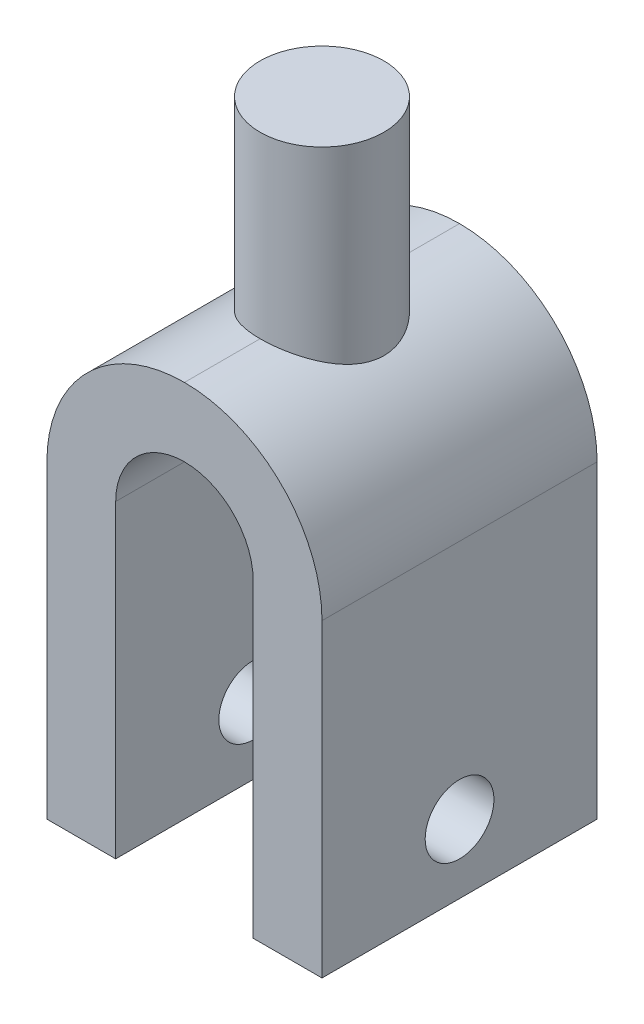
ISO-10303-21;
HEADER;
FILE_DESCRIPTION(('STEP AP214'),'2;1');
FILE_NAME('part.step','',(''),(''),'','','');
FILE_SCHEMA(('AUTOMOTIVE_DESIGN { 1 0 10303 214 1 1 1 1 }'));
ENDSEC;
DATA;
#1=APPLICATION_CONTEXT('core data for automotive mechanical design processes');
#2=APPLICATION_PROTOCOL_DEFINITION('international standard','automotive_design',2000,#1);
#3=PRODUCT_CONTEXT('',#1,'mechanical');
#4=PRODUCT('Part','Part','',(#3));
#5=PRODUCT_RELATED_PRODUCT_CATEGORY('part','',(#4));
#6=PRODUCT_DEFINITION_FORMATION('','',#4);
#7=PRODUCT_DEFINITION_CONTEXT('part definition',#1,'design');
#8=PRODUCT_DEFINITION('design','',#6,#7);
#9=PRODUCT_DEFINITION_SHAPE('','',#8);
#10=(LENGTH_UNIT() NAMED_UNIT(*) SI_UNIT(.MILLI.,.METRE.));
#11=(NAMED_UNIT(*) PLANE_ANGLE_UNIT() SI_UNIT($,.RADIAN.));
#12=(NAMED_UNIT(*) SI_UNIT($,.STERADIAN.) SOLID_ANGLE_UNIT());
#13=UNCERTAINTY_MEASURE_WITH_UNIT(LENGTH_MEASURE(1.E-05),#10,'distance_accuracy_value','');
#14=(GEOMETRIC_REPRESENTATION_CONTEXT(3) GLOBAL_UNCERTAINTY_ASSIGNED_CONTEXT((#13)) GLOBAL_UNIT_ASSIGNED_CONTEXT((#10,
#11,#12)) REPRESENTATION_CONTEXT('',''));
#15=CARTESIAN_POINT('',(0.,0.,0.));
#16=DIRECTION('',(0.,0.,1.));
#17=DIRECTION('',(1.,0.,0.));
#18=AXIS2_PLACEMENT_3D('',#15,#16,#17);
#19=CARTESIAN_POINT('',(0.,-13.,0.));
#20=DIRECTION('',(0.,1.,0.));
#21=DIRECTION('',(-1.,0.,0.));
#22=AXIS2_PLACEMENT_3D('',#19,#20,#21);
#23=CYLINDRICAL_SURFACE('',#22,4.5);
#24=CARTESIAN_POINT('',(0.,-13.,-4.5));
#25=CARTESIAN_POINT('',(-0.120178151652791,-12.9999796580155,-4.50001917389403));
#26=CARTESIAN_POINT('',(-0.240346836842313,-13.0021656662358,-4.49518660422828));
#27=CARTESIAN_POINT('',(-0.47972214591831,-13.0108010186802,-4.47596163300541));
#28=CARTESIAN_POINT('',(-0.59892909053476,-13.0172488766409,-4.46157256414149));
#29=CARTESIAN_POINT('',(-0.835052461657781,-13.0342249399961,-4.42345399919402));
#30=CARTESIAN_POINT('',(-0.95197611092277,-13.0447368195346,-4.39976186917934));
#31=CARTESIAN_POINT('',(-1.18319642373561,-13.069563840303,-4.34329470431343));
#32=CARTESIAN_POINT('',(-1.29749295301557,-13.0838791754538,-4.31051920633869));
#33=CARTESIAN_POINT('',(-1.52256972965127,-13.1159378331901,-4.23624898364253));
#34=CARTESIAN_POINT('',(-1.63335400755732,-13.1336770476286,-4.19476470299124));
#35=CARTESIAN_POINT('',(-1.85089340943453,-13.1721608743311,-4.10342907339228));
#36=CARTESIAN_POINT('',(-1.95764700290549,-13.1929066140268,-4.053574584543));
#37=CARTESIAN_POINT('',(-2.27102094071684,-13.2589571281215,-3.89199694279532));
#38=CARTESIAN_POINT('',(-2.47078895139681,-13.3080803389199,-3.7682481251324));
#39=CARTESIAN_POINT('',(-2.85733198501434,-13.4146989413133,-3.48511508511232));
#40=CARTESIAN_POINT('',(-3.04291597172282,-13.4724944260924,-3.32422927891433));
#41=CARTESIAN_POINT('',(-3.38552575205056,-13.5887849987989,-2.97459101208405));
#42=CARTESIAN_POINT('',(-3.5425372086695,-13.6472804223361,-2.78582464725385));
#43=CARTESIAN_POINT('',(-3.83290511249483,-13.7623204503021,-2.37198960822757));
#44=CARTESIAN_POINT('',(-3.96429305261986,-13.8185408031006,-2.14542753907891));
#45=CARTESIAN_POINT('',(-4.13093668311398,-13.892911754813,-1.78957792461262));
#46=CARTESIAN_POINT('',(-4.18142405814915,-13.9160486023375,-1.66824759865613));
#47=CARTESIAN_POINT('',(-4.27176661677812,-13.958180588836,-1.42101889157476));
#48=CARTESIAN_POINT('',(-4.31162755738027,-13.9771779693967,-1.29512302606237));
#49=CARTESIAN_POINT('',(-4.37841963354644,-14.0094080354816,-1.04648496232591));
#50=CARTESIAN_POINT('',(-4.4059237972701,-14.0228927646251,-0.923928931090382));
#51=CARTESIAN_POINT('',(-4.45062239398908,-14.0449687804154,-0.676567732713107));
#52=CARTESIAN_POINT('',(-4.46782183646064,-14.0535624446738,-0.55176368885237));
#53=CARTESIAN_POINT('',(-4.49169191630349,-14.0655227769069,-0.300945708173625));
#54=CARTESIAN_POINT('',(-4.49836621736068,-14.0688912637019,-0.174932207727762));
#55=CARTESIAN_POINT('',(-4.50110348711771,-14.0702704288533,0.0772334960799677));
#56=CARTESIAN_POINT('',(-4.49716716504251,-14.0682814653072,0.203385689608052));
#57=CARTESIAN_POINT('',(-4.47959275843586,-14.0594555947932,0.443079858232079));
#58=CARTESIAN_POINT('',(-4.4668864266058,-14.053084470478,0.556708209979897));
#59=CARTESIAN_POINT('',(-4.4329358291197,-14.0362158275964,0.782382462581468));
#60=CARTESIAN_POINT('',(-4.41168881196357,-14.0257169792504,0.894427841405261));
#61=CARTESIAN_POINT('',(-4.33544465449631,-13.9884956407401,1.22700182834881));
#62=CARTESIAN_POINT('',(-4.26792995048192,-13.9560404603598,1.44415990475641));
#63=CARTESIAN_POINT('',(-4.10015973351193,-13.8787434590063,1.8687098930679));
#64=CARTESIAN_POINT('',(-3.99919788379175,-13.8336379537341,2.07576959448095));
#65=CARTESIAN_POINT('',(-3.76787788282298,-13.7361549390986,2.47093625011075));
#66=CARTESIAN_POINT('',(-3.63750664038478,-13.6837741952648,2.65903470987385));
#67=CARTESIAN_POINT('',(-3.33583882999429,-13.5712882104201,3.03069111586636));
#68=CARTESIAN_POINT('',(-3.16175229578375,-13.5109345399448,3.21191076910353));
#69=CARTESIAN_POINT('',(-2.78502111429768,-13.3936239645608,3.54352303924676));
#70=CARTESIAN_POINT('',(-2.58236507248389,-13.3366684279114,3.69390329727291));
#71=CARTESIAN_POINT('',(-2.25715889145779,-13.257397721077,3.895155288357));
#72=CARTESIAN_POINT('',(-2.14327023309438,-13.2316516140445,3.95897779521262));
#73=CARTESIAN_POINT('',(-1.90985160011112,-13.1833489365827,4.07670533847978));
#74=CARTESIAN_POINT('',(-1.7903241115997,-13.1607909777368,4.13061469509867));
#75=CARTESIAN_POINT('',(-1.54657596766782,-13.1195463000535,4.22791973859671));
#76=CARTESIAN_POINT('',(-1.42236076837655,-13.1008552353452,4.27132723755885));
#77=CARTESIAN_POINT('',(-1.17012398192434,-13.0678809920973,4.3472006424134));
#78=CARTESIAN_POINT('',(-1.04210395426167,-13.0535960341991,4.3796709656548));
#79=CARTESIAN_POINT('',(-0.763049443416737,-13.0280250136243,4.4374622337394));
#80=CARTESIAN_POINT('',(-0.61153587094907,-13.0175525076043,4.46088210394797));
#81=CARTESIAN_POINT('',(-0.382920521920435,-13.0070418124399,4.48433431388868));
#82=CARTESIAN_POINT('',(-0.306485328663385,-13.0044045884957,4.49020545364922));
#83=CARTESIAN_POINT('',(-0.153372736859748,-13.0008828464352,4.49803856615036));
#84=CARTESIAN_POINT('',(-0.0766953320658565,-12.9999983739031,4.50000043722177));
#85=CARTESIAN_POINT('',(0.,-13.,4.5));
#86=B_SPLINE_CURVE_WITH_KNOTS('',3,(#24,#25,#26,#27,#28,#29,#30,#31,#32,#33,#34,#35,#36,#37,#38,
#39,#40,#41,#42,#43,#44,#45,#46,#47,#48,#49,#50,#51,#52,#53,#54,#55,#56,#57,#58,#59,#60,#61,#62,
#63,#64,#65,#66,#67,#68,#69,#70,#71,#72,#73,#74,#75,#76,#77,#78,#79,#80,#81,#82,#83,#84,#85),
.UNSPECIFIED.,.F.,.F.,(4,2,2,2,2,2,2,2,2,2,2,2,2,2,2,2,2,2,2,2,2,2,2,2,2,2,2,2,2,2,4),(0.,
0.360402629916075,0.720679640489278,1.07952414929391,1.43838695746854,1.79682183057066,
2.15539146438408,2.8724218148803,3.62620944877876,4.38037427827777,5.17950403841125,
5.57935364606037,5.97898618774588,6.35745115539153,6.73573198871505,7.11388111755436,
7.49200497114335,7.83512845896268,8.17836257747507,8.86426099203829,9.56568100304049,
10.2674138598626,11.0393741953104,11.8116432917185,12.2104048263552,12.6089921644363,
13.0071290806821,13.4051050024936,13.8650631802428,14.0950775422091,14.3250978861301),.UNSPECIFIED.);
#87=CARTESIAN_POINT('',(0.,-13.,-4.5));
#88=VERTEX_POINT('',#87);
#89=CARTESIAN_POINT('',(0.,-13.,4.5));
#90=VERTEX_POINT('',#89);
#91=EDGE_CURVE('E11',#88,#90,#86,.T.);
#92=ORIENTED_EDGE('',*,*,#91,.T.);
#93=CARTESIAN_POINT('',(0.,-13.,4.5));
#94=CARTESIAN_POINT('',(0.120178151652796,-12.9999796580155,4.50001917389403));
#95=CARTESIAN_POINT('',(0.240346836842318,-13.0021656662358,4.49518660422828));
#96=CARTESIAN_POINT('',(0.479722145918315,-13.0108010186802,4.47596163300541));
#97=CARTESIAN_POINT('',(0.598929090534764,-13.0172488766409,4.46157256414149));
#98=CARTESIAN_POINT('',(0.835052461657785,-13.0342249399961,4.42345399919402));
#99=CARTESIAN_POINT('',(0.951976110922774,-13.0447368195346,4.39976186917934));
#100=CARTESIAN_POINT('',(1.18319642373561,-13.069563840303,4.34329470431343));
#101=CARTESIAN_POINT('',(1.29749295301557,-13.0838791754538,4.31051920633869));
#102=CARTESIAN_POINT('',(1.52256972965127,-13.1159378331901,4.23624898364253));
#103=CARTESIAN_POINT('',(1.63335400755732,-13.1336770476286,4.19476470299124));
#104=CARTESIAN_POINT('',(1.85089340943453,-13.1721608743311,4.10342907339228));
#105=CARTESIAN_POINT('',(1.95764700290549,-13.1929066140268,4.053574584543));
#106=CARTESIAN_POINT('',(2.27102094071685,-13.2589571281215,3.89199694279531));
#107=CARTESIAN_POINT('',(2.47078895139682,-13.3080803389199,3.7682481251324));
#108=CARTESIAN_POINT('',(2.85733198501435,-13.4146989413133,3.48511508511231));
#109=CARTESIAN_POINT('',(3.04291597172283,-13.4724944260924,3.32422927891432));
#110=CARTESIAN_POINT('',(3.38552575205057,-13.5887849987989,2.97459101208405));
#111=CARTESIAN_POINT('',(3.54253720866951,-13.6472804223361,2.78582464725384));
#112=CARTESIAN_POINT('',(3.83290511249484,-13.7623204503021,2.37198960822757));
#113=CARTESIAN_POINT('',(3.96429305261986,-13.8185408031006,2.1454275390789));
#114=CARTESIAN_POINT('',(4.13093668311398,-13.892911754813,1.78957792461261));
#115=CARTESIAN_POINT('',(4.18142405814915,-13.9160486023375,1.66824759865612));
#116=CARTESIAN_POINT('',(4.27176661677812,-13.958180588836,1.42101889157475));
#117=CARTESIAN_POINT('',(4.31162755738027,-13.9771779693967,1.29512302606236));
#118=CARTESIAN_POINT('',(4.37841963354644,-14.0094080354816,1.0464849623259));
#119=CARTESIAN_POINT('',(4.4059237972701,-14.0228927646251,0.923928931090373));
#120=CARTESIAN_POINT('',(4.45062239398908,-14.0449687804154,0.676567732713099));
#121=CARTESIAN_POINT('',(4.46782183646065,-14.0535624446738,0.551763688852362));
#122=CARTESIAN_POINT('',(4.49169191630349,-14.0655227769069,0.300945708173618));
#123=CARTESIAN_POINT('',(4.49836621736068,-14.0688912637019,0.174932207727755));
#124=CARTESIAN_POINT('',(4.50110348711771,-14.0702704288533,-0.077233496079973));
#125=CARTESIAN_POINT('',(4.49716716504251,-14.0682814653072,-0.203385689608057));
#126=CARTESIAN_POINT('',(4.47959275843586,-14.0594555947932,-0.443079858232084));
#127=CARTESIAN_POINT('',(4.4668864266058,-14.053084470478,-0.556708209979902));
#128=CARTESIAN_POINT('',(4.4329358291197,-14.0362158275964,-0.782382462581474));
#129=CARTESIAN_POINT('',(4.41168881196357,-14.0257169792504,-0.894427841405267));
#130=CARTESIAN_POINT('',(4.33544465449631,-13.9884956407401,-1.22700182834882));
#131=CARTESIAN_POINT('',(4.26792995048192,-13.9560404603598,-1.44415990475642));
#132=CARTESIAN_POINT('',(4.10015973351193,-13.8787434590063,-1.86870989306791));
#133=CARTESIAN_POINT('',(3.99919788379175,-13.8336379537341,-2.07576959448096));
#134=CARTESIAN_POINT('',(3.76787788282298,-13.7361549390986,-2.47093625011076));
#135=CARTESIAN_POINT('',(3.63750664038478,-13.6837741952648,-2.65903470987386));
#136=CARTESIAN_POINT('',(3.33583882999429,-13.5712882104201,-3.03069111586637));
#137=CARTESIAN_POINT('',(3.16175229578374,-13.5109345399447,-3.21191076910353));
#138=CARTESIAN_POINT('',(2.78502111429767,-13.3936239645607,-3.54352303924677));
#139=CARTESIAN_POINT('',(2.58236507248389,-13.3366684279114,-3.69390329727292));
#140=CARTESIAN_POINT('',(2.25715889145778,-13.257397721077,-3.89515528835701));
#141=CARTESIAN_POINT('',(2.14327023309437,-13.2316516140445,-3.95897779521263));
#142=CARTESIAN_POINT('',(1.90985160011111,-13.1833489365827,-4.07670533847979));
#143=CARTESIAN_POINT('',(1.79032411159969,-13.1607909777368,-4.13061469509867));
#144=CARTESIAN_POINT('',(1.54657596766782,-13.1195463000535,-4.22791973859672));
#145=CARTESIAN_POINT('',(1.42236076837654,-13.1008552353452,-4.27132723755885));
#146=CARTESIAN_POINT('',(1.17012398192434,-13.0678809920973,-4.3472006424134));
#147=CARTESIAN_POINT('',(1.04210395426166,-13.0535960341991,-4.3796709656548));
#148=CARTESIAN_POINT('',(0.763049443416733,-13.0280250136243,-4.4374622337394));
#149=CARTESIAN_POINT('',(0.611535870949068,-13.0175525076043,-4.46088210394797));
#150=CARTESIAN_POINT('',(0.382920521920436,-13.0070418124399,-4.48433431388868));
#151=CARTESIAN_POINT('',(0.306485328663387,-13.0044045884957,-4.49020545364922));
#152=CARTESIAN_POINT('',(0.153372736859752,-13.0008828464352,-4.49803856615036));
#153=CARTESIAN_POINT('',(0.0766953320658608,-12.9999983739031,-4.50000043722177));
#154=CARTESIAN_POINT('',(0.,-13.,-4.5));
#155=B_SPLINE_CURVE_WITH_KNOTS('',3,(#93,#94,#95,#96,#97,#98,#99,#100,#101,#102,#103,#104,#105,
#106,#107,#108,#109,#110,#111,#112,#113,#114,#115,#116,#117,#118,#119,#120,#121,#122,#123,#124,
#125,#126,#127,#128,#129,#130,#131,#132,#133,#134,#135,#136,#137,#138,#139,#140,#141,#142,#143,
#144,#145,#146,#147,#148,#149,#150,#151,#152,#153,#154),.UNSPECIFIED.,.F.,.F.,(4,2,2,2,2,2,2,2,
2,2,2,2,2,2,2,2,2,2,2,2,2,2,2,2,2,2,2,2,2,2,4),(0.,0.360402629916075,0.720679640489277,
1.07952414929391,1.43838695746853,1.79682183057065,2.15539146438408,2.87242181488031,
3.62620944877876,4.38037427827777,5.17950403841125,5.57935364606038,5.97898618774588,
6.35745115539153,6.73573198871505,7.11388111755436,7.49200497114335,7.83512845896269,
8.17836257747507,8.8642609920383,9.56568100304049,10.2674138598626,11.0393741953104,
11.8116432917185,12.2104048263552,12.6089921644363,13.0071290806821,13.4051050024936,
13.8650631802428,14.0950775422091,14.3250978861301),.UNSPECIFIED.);
#156=EDGE_CURVE('E30',#90,#88,#155,.T.);
#157=ORIENTED_EDGE('',*,*,#156,.T.);
#158=EDGE_LOOP('',(#92,#157));
#159=FACE_BOUND('',#158,.T.);
#160=CARTESIAN_POINT('',(0.,0.,0.));
#161=DIRECTION('',(0.,-1.,0.));
#162=DIRECTION('',(1.,0.,0.));
#163=AXIS2_PLACEMENT_3D('',#160,#161,#162);
#164=CIRCLE('',#163,4.5);
#165=CARTESIAN_POINT('',(4.5,0.,0.));
#166=VERTEX_POINT('',#165);
#167=EDGE_CURVE('E241',#166,#166,#164,.T.);
#168=ORIENTED_EDGE('',*,*,#167,.T.);
#169=EDGE_LOOP('',(#168));
#170=FACE_BOUND('',#169,.T.);
#171=ADVANCED_FACE('F17',(#159,#170),#23,.T.);
#172=CARTESIAN_POINT('',(0.,0.,0.));
#173=DIRECTION('',(0.,-1.,0.));
#174=DIRECTION('',(1.,0.,0.));
#175=AXIS2_PLACEMENT_3D('',#172,#173,#174);
#176=PLANE('',#175);
#177=ORIENTED_EDGE('',*,*,#167,.F.);
#178=EDGE_LOOP('',(#177));
#179=FACE_BOUND('',#178,.T.);
#180=ADVANCED_FACE('F252',(#179),#176,.F.);
#181=CARTESIAN_POINT('',(10.,-18.,10.));
#182=DIRECTION('',(-1.,0.,0.));
#183=DIRECTION('',(0.,0.,-1.));
#184=AXIS2_PLACEMENT_3D('',#181,#182,#183);
#185=PLANE('',#184);
#186=CARTESIAN_POINT('',(10.,-40.5,0.));
#187=DIRECTION('',(1.,0.,0.));
#188=DIRECTION('',(0.,0.,1.));
#189=AXIS2_PLACEMENT_3D('',#186,#187,#188);
#190=CIRCLE('',#189,2.5);
#191=CARTESIAN_POINT('',(10.,-40.5,2.5));
#192=VERTEX_POINT('',#191);
#193=EDGE_CURVE('E237',#192,#192,#190,.T.);
#194=ORIENTED_EDGE('',*,*,#193,.F.);
#195=EDGE_LOOP('',(#194));
#196=FACE_BOUND('',#195,.T.);
#197=DIRECTION('',(0.,1.,0.));
#198=VECTOR('',#197,1.);
#199=CARTESIAN_POINT('',(10.,-18.,-10.));
#200=LINE('',#199,#198);
#201=CARTESIAN_POINT('',(10.,-45.5,-10.));
#202=VERTEX_POINT('',#201);
#203=CARTESIAN_POINT('',(10.,-23.,-10.));
#204=VERTEX_POINT('',#203);
#205=EDGE_CURVE('E234',#202,#204,#200,.T.);
#206=ORIENTED_EDGE('',*,*,#205,.T.);
#207=DIRECTION('',(0.,0.,1.));
#208=VECTOR('',#207,1.);
#209=CARTESIAN_POINT('',(10.,-23.,10.));
#210=LINE('',#209,#208);
#211=CARTESIAN_POINT('',(10.,-23.,10.));
#212=VERTEX_POINT('',#211);
#213=EDGE_CURVE('E231',#204,#212,#210,.T.);
#214=ORIENTED_EDGE('',*,*,#213,.T.);
#215=DIRECTION('',(0.,1.,0.));
#216=VECTOR('',#215,1.);
#217=CARTESIAN_POINT('',(10.,-18.,10.));
#218=LINE('',#217,#216);
#219=CARTESIAN_POINT('',(10.,-45.5,10.));
#220=VERTEX_POINT('',#219);
#221=EDGE_CURVE('E227',#220,#212,#218,.T.);
#222=ORIENTED_EDGE('',*,*,#221,.F.);
#223=DIRECTION('',(0.,0.,1.));
#224=VECTOR('',#223,1.);
#225=CARTESIAN_POINT('',(10.,-45.5,10.));
#226=LINE('',#225,#224);
#227=EDGE_CURVE('E223',#202,#220,#226,.T.);
#228=ORIENTED_EDGE('',*,*,#227,.F.);
#229=EDGE_LOOP('',(#206,#214,#222,#228));
#230=FACE_BOUND('',#229,.T.);
#231=ADVANCED_FACE('F256',(#196,#230),#185,.F.);
#232=CARTESIAN_POINT('',(-10.,-18.,10.));
#233=DIRECTION('',(0.,0.,-1.));
#234=DIRECTION('',(0.,1.,0.));
#235=AXIS2_PLACEMENT_3D('',#232,#233,#234);
#236=PLANE('',#235);
#237=CARTESIAN_POINT('',(0.,-23.,10.));
#238=DIRECTION('',(0.,0.,-1.));
#239=DIRECTION('',(0.,1.,0.));
#240=AXIS2_PLACEMENT_3D('',#237,#238,#239);
#241=CIRCLE('',#240,10.);
#242=CARTESIAN_POINT('',(0.,-13.,10.));
#243=VERTEX_POINT('',#242);
#244=EDGE_CURVE('E220',#212,#243,#241,.F.);
#245=ORIENTED_EDGE('',*,*,#244,.T.);
#246=CARTESIAN_POINT('',(0.,-23.,10.));
#247=DIRECTION('',(0.,0.,-1.));
#248=DIRECTION('',(0.,1.,0.));
#249=AXIS2_PLACEMENT_3D('',#246,#247,#248);
#250=CIRCLE('',#249,10.);
#251=CARTESIAN_POINT('',(-10.,-23.,10.));
#252=VERTEX_POINT('',#251);
#253=EDGE_CURVE('E217',#243,#252,#250,.F.);
#254=ORIENTED_EDGE('',*,*,#253,.T.);
#255=DIRECTION('',(0.,1.,0.));
#256=VECTOR('',#255,1.);
#257=CARTESIAN_POINT('',(-10.,-18.,10.));
#258=LINE('',#257,#256);
#259=CARTESIAN_POINT('',(-10.,-45.5,10.));
#260=VERTEX_POINT('',#259);
#261=EDGE_CURVE('E213',#260,#252,#258,.T.);
#262=ORIENTED_EDGE('',*,*,#261,.F.);
#263=DIRECTION('',(-1.,0.,0.));
#264=VECTOR('',#263,1.);
#265=CARTESIAN_POINT('',(-10.,-45.5,10.));
#266=LINE('',#265,#264);
#267=CARTESIAN_POINT('',(-5.,-45.5,10.));
#268=VERTEX_POINT('',#267);
#269=EDGE_CURVE('E210',#268,#260,#266,.T.);
#270=ORIENTED_EDGE('',*,*,#269,.F.);
#271=DIRECTION('',(0.,1.,0.));
#272=VECTOR('',#271,1.);
#273=CARTESIAN_POINT('',(-5.,-45.5,10.));
#274=LINE('',#273,#272);
#275=CARTESIAN_POINT('',(-5.,-23.,10.));
#276=VERTEX_POINT('',#275);
#277=EDGE_CURVE('E144',#268,#276,#274,.T.);
#278=ORIENTED_EDGE('',*,*,#277,.T.);
#279=CARTESIAN_POINT('',(0.,-23.,10.));
#280=DIRECTION('',(0.,0.,-1.));
#281=DIRECTION('',(0.,1.,0.));
#282=AXIS2_PLACEMENT_3D('',#279,#280,#281);
#283=CIRCLE('',#282,5.);
#284=CARTESIAN_POINT('',(0.,-18.,10.));
#285=VERTEX_POINT('',#284);
#286=EDGE_CURVE('E205',#276,#285,#283,.T.);
#287=ORIENTED_EDGE('',*,*,#286,.T.);
#288=CARTESIAN_POINT('',(0.,-23.,10.));
#289=DIRECTION('',(0.,0.,-1.));
#290=DIRECTION('',(0.,1.,0.));
#291=AXIS2_PLACEMENT_3D('',#288,#289,#290);
#292=CIRCLE('',#291,5.);
#293=CARTESIAN_POINT('',(5.,-23.,10.));
#294=VERTEX_POINT('',#293);
#295=EDGE_CURVE('E202',#285,#294,#292,.T.);
#296=ORIENTED_EDGE('',*,*,#295,.T.);
#297=DIRECTION('',(0.,1.,0.));
#298=VECTOR('',#297,1.);
#299=CARTESIAN_POINT('',(5.,-45.5,10.));
#300=LINE('',#299,#298);
#301=CARTESIAN_POINT('',(5.,-45.5,10.));
#302=VERTEX_POINT('',#301);
#303=EDGE_CURVE('E198',#302,#294,#300,.T.);
#304=ORIENTED_EDGE('',*,*,#303,.F.);
#305=DIRECTION('',(-1.,0.,0.));
#306=VECTOR('',#305,1.);
#307=CARTESIAN_POINT('',(10.,-45.5,10.));
#308=LINE('',#307,#306);
#309=EDGE_CURVE('E194',#220,#302,#308,.T.);
#310=ORIENTED_EDGE('',*,*,#309,.F.);
#311=ORIENTED_EDGE('',*,*,#221,.T.);
#312=EDGE_LOOP('',(#245,#254,#262,#270,#278,#287,#296,#304,#310,#311));
#313=FACE_BOUND('',#312,.T.);
#314=ADVANCED_FACE('F260',(#313),#236,.F.);
#315=CARTESIAN_POINT('',(-10.,-18.,10.));
#316=DIRECTION('',(1.,0.,0.));
#317=DIRECTION('',(0.,0.,1.));
#318=AXIS2_PLACEMENT_3D('',#315,#316,#317);
#319=PLANE('',#318);
#320=CARTESIAN_POINT('',(-10.,-40.5,0.));
#321=DIRECTION('',(1.,0.,0.));
#322=DIRECTION('',(0.,0.,1.));
#323=AXIS2_PLACEMENT_3D('',#320,#321,#322);
#324=CIRCLE('',#323,2.5);
#325=CARTESIAN_POINT('',(-10.,-40.5,2.5));
#326=VERTEX_POINT('',#325);
#327=EDGE_CURVE('E190',#326,#326,#324,.T.);
#328=ORIENTED_EDGE('',*,*,#327,.T.);
#329=EDGE_LOOP('',(#328));
#330=FACE_BOUND('',#329,.T.);
#331=ORIENTED_EDGE('',*,*,#261,.T.);
#332=DIRECTION('',(0.,0.,-1.));
#333=VECTOR('',#332,1.);
#334=CARTESIAN_POINT('',(-10.,-23.,10.));
#335=LINE('',#334,#333);
#336=CARTESIAN_POINT('',(-10.,-23.,-10.));
#337=VERTEX_POINT('',#336);
#338=EDGE_CURVE('E187',#252,#337,#335,.T.);
#339=ORIENTED_EDGE('',*,*,#338,.T.);
#340=DIRECTION('',(0.,1.,0.));
#341=VECTOR('',#340,1.);
#342=CARTESIAN_POINT('',(-10.,-18.,-10.));
#343=LINE('',#342,#341);
#344=CARTESIAN_POINT('',(-10.,-45.5,-10.));
#345=VERTEX_POINT('',#344);
#346=EDGE_CURVE('E184',#345,#337,#343,.T.);
#347=ORIENTED_EDGE('',*,*,#346,.F.);
#348=DIRECTION('',(0.,0.,-1.));
#349=VECTOR('',#348,1.);
#350=CARTESIAN_POINT('',(-10.,-45.5,10.));
#351=LINE('',#350,#349);
#352=EDGE_CURVE('E153',#260,#345,#351,.T.);
#353=ORIENTED_EDGE('',*,*,#352,.F.);
#354=EDGE_LOOP('',(#331,#339,#347,#353));
#355=FACE_BOUND('',#354,.T.);
#356=ADVANCED_FACE('F264',(#330,#355),#319,.F.);
#357=CARTESIAN_POINT('',(-10.,-18.,-10.));
#358=DIRECTION('',(0.,0.,1.));
#359=DIRECTION('',(0.,-1.,0.));
#360=AXIS2_PLACEMENT_3D('',#357,#358,#359);
#361=PLANE('',#360);
#362=ORIENTED_EDGE('',*,*,#346,.T.);
#363=CARTESIAN_POINT('',(0.,-23.,-10.));
#364=DIRECTION('',(0.,0.,1.));
#365=DIRECTION('',(0.,-1.,0.));
#366=AXIS2_PLACEMENT_3D('',#363,#364,#365);
#367=CIRCLE('',#366,10.);
#368=CARTESIAN_POINT('',(0.,-13.,-10.));
#369=VERTEX_POINT('',#368);
#370=EDGE_CURVE('E179',#337,#369,#367,.F.);
#371=ORIENTED_EDGE('',*,*,#370,.T.);
#372=CARTESIAN_POINT('',(0.,-23.,-10.));
#373=DIRECTION('',(0.,0.,1.));
#374=DIRECTION('',(0.,-1.,0.));
#375=AXIS2_PLACEMENT_3D('',#372,#373,#374);
#376=CIRCLE('',#375,10.);
#377=EDGE_CURVE('E175',#369,#204,#376,.F.);
#378=ORIENTED_EDGE('',*,*,#377,.T.);
#379=ORIENTED_EDGE('',*,*,#205,.F.);
#380=DIRECTION('',(1.,0.,0.));
#381=VECTOR('',#380,1.);
#382=CARTESIAN_POINT('',(10.,-45.5,-10.));
#383=LINE('',#382,#381);
#384=CARTESIAN_POINT('',(5.,-45.5,-10.));
#385=VERTEX_POINT('',#384);
#386=EDGE_CURVE('E171',#385,#202,#383,.T.);
#387=ORIENTED_EDGE('',*,*,#386,.F.);
#388=DIRECTION('',(0.,1.,0.));
#389=VECTOR('',#388,1.);
#390=CARTESIAN_POINT('',(5.,-45.5,-10.));
#391=LINE('',#390,#389);
#392=CARTESIAN_POINT('',(5.,-23.,-10.));
#393=VERTEX_POINT('',#392);
#394=EDGE_CURVE('E168',#385,#393,#391,.T.);
#395=ORIENTED_EDGE('',*,*,#394,.T.);
#396=CARTESIAN_POINT('',(0.,-23.,-10.));
#397=DIRECTION('',(0.,0.,1.));
#398=DIRECTION('',(0.,-1.,0.));
#399=AXIS2_PLACEMENT_3D('',#396,#397,#398);
#400=CIRCLE('',#399,5.);
#401=CARTESIAN_POINT('',(0.,-18.,-10.));
#402=VERTEX_POINT('',#401);
#403=EDGE_CURVE('E165',#393,#402,#400,.T.);
#404=ORIENTED_EDGE('',*,*,#403,.T.);
#405=CARTESIAN_POINT('',(0.,-23.,-10.));
#406=DIRECTION('',(0.,0.,1.));
#407=DIRECTION('',(0.,-1.,0.));
#408=AXIS2_PLACEMENT_3D('',#405,#406,#407);
#409=CIRCLE('',#408,5.);
#410=CARTESIAN_POINT('',(-5.,-23.,-10.));
#411=VERTEX_POINT('',#410);
#412=EDGE_CURVE('E134',#402,#411,#409,.T.);
#413=ORIENTED_EDGE('',*,*,#412,.T.);
#414=DIRECTION('',(0.,1.,0.));
#415=VECTOR('',#414,1.);
#416=CARTESIAN_POINT('',(-5.,-45.5,-10.));
#417=LINE('',#416,#415);
#418=CARTESIAN_POINT('',(-5.,-45.5,-10.));
#419=VERTEX_POINT('',#418);
#420=EDGE_CURVE('E126',#419,#411,#417,.T.);
#421=ORIENTED_EDGE('',*,*,#420,.F.);
#422=DIRECTION('',(1.,0.,0.));
#423=VECTOR('',#422,1.);
#424=CARTESIAN_POINT('',(-10.,-45.5,-10.));
#425=LINE('',#424,#423);
#426=EDGE_CURVE('E131',#345,#419,#425,.T.);
#427=ORIENTED_EDGE('',*,*,#426,.F.);
#428=EDGE_LOOP('',(#362,#371,#378,#379,#387,#395,#404,#413,#421,#427));
#429=FACE_BOUND('',#428,.T.);
#430=ADVANCED_FACE('F129',(#429),#361,.F.);
#431=CARTESIAN_POINT('',(-5.,-45.5,10.));
#432=DIRECTION('',(-1.,0.,0.));
#433=DIRECTION('',(0.,0.,-1.));
#434=AXIS2_PLACEMENT_3D('',#431,#432,#433);
#435=PLANE('',#434);
#436=CARTESIAN_POINT('',(-5.,-40.5,0.));
#437=DIRECTION('',(-1.,0.,0.));
#438=DIRECTION('',(0.,0.,-1.));
#439=AXIS2_PLACEMENT_3D('',#436,#437,#438);
#440=CIRCLE('',#439,2.5);
#441=CARTESIAN_POINT('',(-5.,-40.5,-2.5));
#442=VERTEX_POINT('',#441);
#443=EDGE_CURVE('E155',#442,#442,#440,.T.);
#444=ORIENTED_EDGE('',*,*,#443,.T.);
#445=EDGE_LOOP('',(#444));
#446=FACE_BOUND('',#445,.T.);
#447=ORIENTED_EDGE('',*,*,#420,.T.);
#448=DIRECTION('',(0.,0.,1.));
#449=VECTOR('',#448,1.);
#450=CARTESIAN_POINT('',(-5.,-23.,10.));
#451=LINE('',#450,#449);
#452=EDGE_CURVE('E148',#411,#276,#451,.T.);
#453=ORIENTED_EDGE('',*,*,#452,.T.);
#454=ORIENTED_EDGE('',*,*,#277,.F.);
#455=DIRECTION('',(0.,0.,1.));
#456=VECTOR('',#455,1.);
#457=CARTESIAN_POINT('',(-5.,-45.5,10.));
#458=LINE('',#457,#456);
#459=EDGE_CURVE('E142',#419,#268,#458,.T.);
#460=ORIENTED_EDGE('',*,*,#459,.F.);
#461=EDGE_LOOP('',(#447,#453,#454,#460));
#462=FACE_BOUND('',#461,.T.);
#463=ADVANCED_FACE('F143',(#446,#462),#435,.F.);
#464=CARTESIAN_POINT('',(0.,-45.5,0.));
#465=DIRECTION('',(0.,-1.,0.));
#466=DIRECTION('',(1.,0.,0.));
#467=AXIS2_PLACEMENT_3D('',#464,#465,#466);
#468=PLANE('',#467);
#469=ORIENTED_EDGE('',*,*,#352,.T.);
#470=ORIENTED_EDGE('',*,*,#426,.T.);
#471=ORIENTED_EDGE('',*,*,#459,.T.);
#472=ORIENTED_EDGE('',*,*,#269,.T.);
#473=EDGE_LOOP('',(#469,#470,#471,#472));
#474=FACE_BOUND('',#473,.T.);
#475=ADVANCED_FACE('F151',(#474),#468,.T.);
#476=CARTESIAN_POINT('',(5.,-45.5,10.));
#477=DIRECTION('',(1.,0.,0.));
#478=DIRECTION('',(0.,0.,1.));
#479=AXIS2_PLACEMENT_3D('',#476,#477,#478);
#480=PLANE('',#479);
#481=CARTESIAN_POINT('',(5.,-40.5,0.));
#482=DIRECTION('',(1.,0.,0.));
#483=DIRECTION('',(0.,0.,1.));
#484=AXIS2_PLACEMENT_3D('',#481,#482,#483);
#485=CIRCLE('',#484,2.5);
#486=CARTESIAN_POINT('',(5.,-40.5,2.5));
#487=VERTEX_POINT('',#486);
#488=EDGE_CURVE('E149',#487,#487,#485,.T.);
#489=ORIENTED_EDGE('',*,*,#488,.T.);
#490=EDGE_LOOP('',(#489));
#491=FACE_BOUND('',#490,.T.);
#492=ORIENTED_EDGE('',*,*,#303,.T.);
#493=DIRECTION('',(0.,0.,-1.));
#494=VECTOR('',#493,1.);
#495=CARTESIAN_POINT('',(5.,-23.,10.));
#496=LINE('',#495,#494);
#497=EDGE_CURVE('E515',#294,#393,#496,.T.);
#498=ORIENTED_EDGE('',*,*,#497,.T.);
#499=ORIENTED_EDGE('',*,*,#394,.F.);
#500=DIRECTION('',(0.,0.,-1.));
#501=VECTOR('',#500,1.);
#502=CARTESIAN_POINT('',(5.,-45.5,10.));
#503=LINE('',#502,#501);
#504=EDGE_CURVE('E510',#302,#385,#503,.T.);
#505=ORIENTED_EDGE('',*,*,#504,.F.);
#506=EDGE_LOOP('',(#492,#498,#499,#505));
#507=FACE_BOUND('',#506,.T.);
#508=ADVANCED_FACE('F276',(#491,#507),#480,.F.);
#509=CARTESIAN_POINT('',(0.,-45.5,0.));
#510=DIRECTION('',(0.,1.,0.));
#511=DIRECTION('',(-1.,0.,0.));
#512=AXIS2_PLACEMENT_3D('',#509,#510,#511);
#513=PLANE('',#512);
#514=ORIENTED_EDGE('',*,*,#227,.T.);
#515=ORIENTED_EDGE('',*,*,#309,.T.);
#516=ORIENTED_EDGE('',*,*,#504,.T.);
#517=ORIENTED_EDGE('',*,*,#386,.T.);
#518=EDGE_LOOP('',(#514,#515,#516,#517));
#519=FACE_BOUND('',#518,.T.);
#520=ADVANCED_FACE('F279',(#519),#513,.F.);
#521=CARTESIAN_POINT('',(0.,-23.,10.));
#522=DIRECTION('',(0.,0.,1.));
#523=DIRECTION('',(-1.,0.,0.));
#524=AXIS2_PLACEMENT_3D('',#521,#522,#523);
#525=CYLINDRICAL_SURFACE('',#524,10.);
#526=DIRECTION('',(0.,0.,1.));
#527=VECTOR('',#526,1.);
#528=CARTESIAN_POINT('',(0.,-13.,0.));
#529=LINE('',#528,#527);
#530=EDGE_CURVE('E505',#88,#369,#529,.F.);
#531=ORIENTED_EDGE('',*,*,#530,.F.);
#532=ORIENTED_EDGE('',*,*,#156,.F.);
#533=DIRECTION('',(0.,0.,1.));
#534=VECTOR('',#533,1.);
#535=CARTESIAN_POINT('',(0.,-13.,0.));
#536=LINE('',#535,#534);
#537=EDGE_CURVE('E500',#243,#90,#536,.F.);
#538=ORIENTED_EDGE('',*,*,#537,.F.);
#539=ORIENTED_EDGE('',*,*,#244,.F.);
#540=ORIENTED_EDGE('',*,*,#213,.F.);
#541=ORIENTED_EDGE('',*,*,#377,.F.);
#542=EDGE_LOOP('',(#531,#532,#538,#539,#540,#541));
#543=FACE_BOUND('',#542,.T.);
#544=ADVANCED_FACE('F283',(#543),#525,.T.);
#545=CARTESIAN_POINT('',(0.,-23.,10.));
#546=DIRECTION('',(0.,0.,-1.));
#547=DIRECTION('',(1.,0.,0.));
#548=AXIS2_PLACEMENT_3D('',#545,#546,#547);
#549=CYLINDRICAL_SURFACE('',#548,10.);
#550=ORIENTED_EDGE('',*,*,#91,.F.);
#551=ORIENTED_EDGE('',*,*,#530,.T.);
#552=ORIENTED_EDGE('',*,*,#370,.F.);
#553=ORIENTED_EDGE('',*,*,#338,.F.);
#554=ORIENTED_EDGE('',*,*,#253,.F.);
#555=ORIENTED_EDGE('',*,*,#537,.T.);
#556=EDGE_LOOP('',(#550,#551,#552,#553,#554,#555));
#557=FACE_BOUND('',#556,.T.);
#558=ADVANCED_FACE('F287',(#557),#549,.T.);
#559=CARTESIAN_POINT('',(-25.,-40.5,0.));
#560=DIRECTION('',(1.,0.,0.));
#561=DIRECTION('',(0.,0.,1.));
#562=AXIS2_PLACEMENT_3D('',#559,#560,#561);
#563=CYLINDRICAL_SURFACE('',#562,2.5);
#564=ORIENTED_EDGE('',*,*,#193,.T.);
#565=EDGE_LOOP('',(#564));
#566=FACE_BOUND('',#565,.T.);
#567=ORIENTED_EDGE('',*,*,#488,.F.);
#568=EDGE_LOOP('',(#567));
#569=FACE_BOUND('',#568,.T.);
#570=ADVANCED_FACE('F291',(#566,#569),#563,.F.);
#571=CARTESIAN_POINT('',(-25.,-40.5,0.));
#572=DIRECTION('',(1.,0.,0.));
#573=DIRECTION('',(0.,0.,1.));
#574=AXIS2_PLACEMENT_3D('',#571,#572,#573);
#575=CYLINDRICAL_SURFACE('',#574,2.5);
#576=ORIENTED_EDGE('',*,*,#443,.F.);
#577=EDGE_LOOP('',(#576));
#578=FACE_BOUND('',#577,.T.);
#579=ORIENTED_EDGE('',*,*,#327,.F.);
#580=EDGE_LOOP('',(#579));
#581=FACE_BOUND('',#580,.T.);
#582=ADVANCED_FACE('F295',(#578,#581),#575,.F.);
#583=CARTESIAN_POINT('',(0.,-23.,10.));
#584=DIRECTION('',(0.,0.,1.));
#585=DIRECTION('',(-1.,0.,0.));
#586=AXIS2_PLACEMENT_3D('',#583,#584,#585);
#587=CYLINDRICAL_SURFACE('',#586,5.);
#588=DIRECTION('',(0.,0.,1.));
#589=VECTOR('',#588,1.);
#590=CARTESIAN_POINT('',(0.,-18.,0.));
#591=LINE('',#590,#589);
#592=EDGE_CURVE('E496',#285,#402,#591,.F.);
#593=ORIENTED_EDGE('',*,*,#592,.F.);
#594=ORIENTED_EDGE('',*,*,#286,.F.);
#595=ORIENTED_EDGE('',*,*,#452,.F.);
#596=ORIENTED_EDGE('',*,*,#412,.F.);
#597=EDGE_LOOP('',(#593,#594,#595,#596));
#598=FACE_BOUND('',#597,.T.);
#599=ADVANCED_FACE('F299',(#598),#587,.F.);
#600=CARTESIAN_POINT('',(0.,-23.,10.));
#601=DIRECTION('',(0.,0.,-1.));
#602=DIRECTION('',(1.,0.,0.));
#603=AXIS2_PLACEMENT_3D('',#600,#601,#602);
#604=CYLINDRICAL_SURFACE('',#603,5.);
#605=ORIENTED_EDGE('',*,*,#295,.F.);
#606=ORIENTED_EDGE('',*,*,#592,.T.);
#607=ORIENTED_EDGE('',*,*,#403,.F.);
#608=ORIENTED_EDGE('',*,*,#497,.F.);
#609=EDGE_LOOP('',(#605,#606,#607,#608));
#610=FACE_BOUND('',#609,.T.);
#611=ADVANCED_FACE('F303',(#610),#604,.F.);
#612=CLOSED_SHELL('',(#171,#180,#231,#314,#356,#430,#463,#475,#508,#520,#544,#558,#570,#582,
#599,#611));
#613=MANIFOLD_SOLID_BREP('B1',#612);
#614=ADVANCED_BREP_SHAPE_REPRESENTATION('',(#18,#613),#14);
#615=SHAPE_DEFINITION_REPRESENTATION(#9,#614);
ENDSEC;
END-ISO-10303-21;
